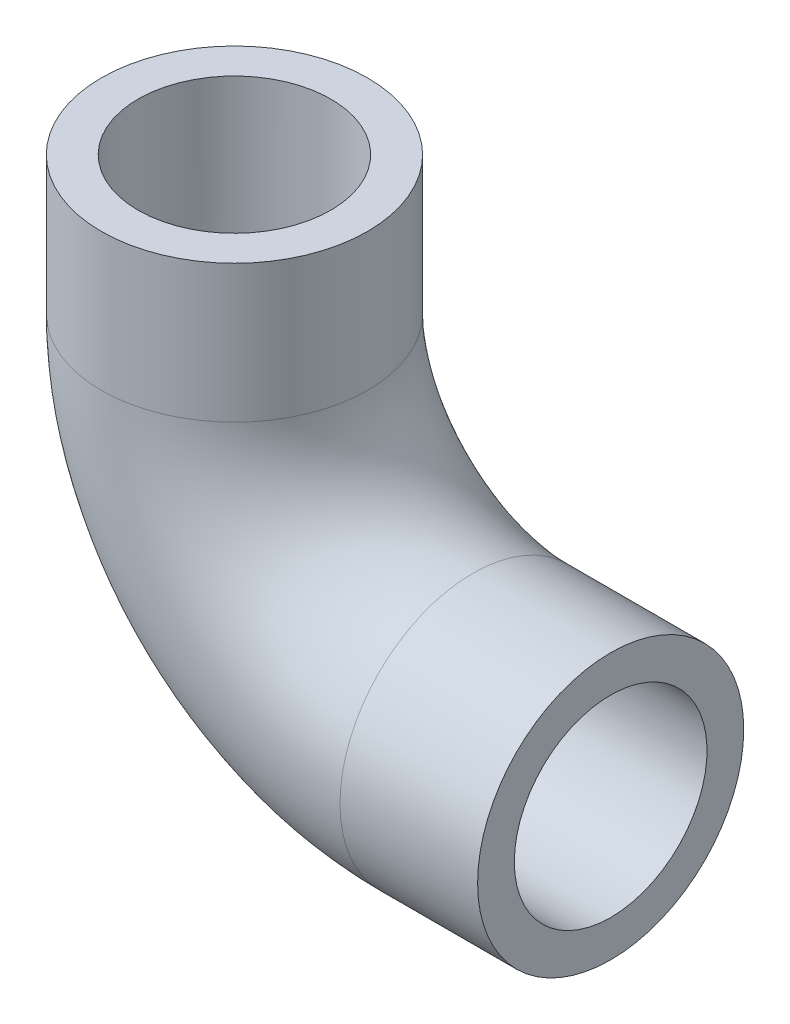
ISO-10303-21;
HEADER;
FILE_DESCRIPTION(('STEP AP214'),'2;1');
FILE_NAME('part.step','',(''),(''),'','','');
FILE_SCHEMA(('AUTOMOTIVE_DESIGN { 1 0 10303 214 1 1 1 1 }'));
ENDSEC;
DATA;
#1=APPLICATION_CONTEXT('core data for automotive mechanical design processes');
#2=APPLICATION_PROTOCOL_DEFINITION('international standard','automotive_design',2000,#1);
#3=PRODUCT_CONTEXT('',#1,'mechanical');
#4=PRODUCT('Part','Part','',(#3));
#5=PRODUCT_RELATED_PRODUCT_CATEGORY('part','',(#4));
#6=PRODUCT_DEFINITION_FORMATION('','',#4);
#7=PRODUCT_DEFINITION_CONTEXT('part definition',#1,'design');
#8=PRODUCT_DEFINITION('design','',#6,#7);
#9=PRODUCT_DEFINITION_SHAPE('','',#8);
#10=(LENGTH_UNIT() NAMED_UNIT(*) SI_UNIT(.MILLI.,.METRE.));
#11=(NAMED_UNIT(*) PLANE_ANGLE_UNIT() SI_UNIT($,.RADIAN.));
#12=(NAMED_UNIT(*) SI_UNIT($,.STERADIAN.) SOLID_ANGLE_UNIT());
#13=UNCERTAINTY_MEASURE_WITH_UNIT(LENGTH_MEASURE(1.E-05),#10,'distance_accuracy_value','');
#14=(GEOMETRIC_REPRESENTATION_CONTEXT(3) GLOBAL_UNCERTAINTY_ASSIGNED_CONTEXT((#13)) GLOBAL_UNIT_ASSIGNED_CONTEXT((#10,
#11,#12)) REPRESENTATION_CONTEXT('',''));
#15=CARTESIAN_POINT('',(0.,0.,0.));
#16=DIRECTION('',(0.,0.,1.));
#17=DIRECTION('',(1.,0.,0.));
#18=AXIS2_PLACEMENT_3D('',#15,#16,#17);
#19=CARTESIAN_POINT('',(0.,0.,0.));
#20=DIRECTION('',(0.,-1.,0.));
#21=DIRECTION('',(1.,0.,0.));
#22=AXIS2_PLACEMENT_3D('',#19,#20,#21);
#23=CYLINDRICAL_SURFACE('',#22,145.);
#24=CARTESIAN_POINT('',(0.,-150.,0.));
#25=DIRECTION('',(0.,1.,0.));
#26=DIRECTION('',(0.,0.,1.));
#27=AXIS2_PLACEMENT_3D('',#24,#25,#26);
#28=CIRCLE('',#27,145.);
#29=CARTESIAN_POINT('',(-145.,-150.,0.));
#30=VERTEX_POINT('',#29);
#31=EDGE_CURVE('E64',#30,#30,#28,.T.);
#32=ORIENTED_EDGE('',*,*,#31,.T.);
#33=EDGE_LOOP('',(#32));
#34=FACE_BOUND('',#33,.T.);
#35=CARTESIAN_POINT('',(0.,0.,0.));
#36=DIRECTION('',(0.,1.,0.));
#37=DIRECTION('',(0.,0.,1.));
#38=AXIS2_PLACEMENT_3D('',#35,#36,#37);
#39=CIRCLE('',#38,145.);
#40=CARTESIAN_POINT('',(0.,0.,145.));
#41=VERTEX_POINT('',#40);
#42=EDGE_CURVE('E61',#41,#41,#39,.T.);
#43=ORIENTED_EDGE('',*,*,#42,.F.);
#44=EDGE_LOOP('',(#43));
#45=FACE_BOUND('',#44,.T.);
#46=ADVANCED_FACE('F37',(#34,#45),#23,.T.);
#47=CARTESIAN_POINT('',(260.,-150.,0.));
#48=DIRECTION('',(0.,0.,1.));
#49=DIRECTION('',(1.,0.,0.));
#50=AXIS2_PLACEMENT_3D('',#47,#48,#49);
#51=TOROIDAL_SURFACE('',#50,260.,145.);
#52=CARTESIAN_POINT('',(260.000000000001,-410.,0.));
#53=DIRECTION('',(-1.,0.,0.));
#54=DIRECTION('',(0.,0.,1.));
#55=AXIS2_PLACEMENT_3D('',#52,#53,#54);
#56=CIRCLE('',#55,145.);
#57=CARTESIAN_POINT('',(260.000000000001,-555.,0.));
#58=VERTEX_POINT('',#57);
#59=EDGE_CURVE('E41',#58,#58,#56,.T.);
#60=CARTESIAN_POINT('',(260.,-150.,0.));
#61=DIRECTION('',(0.,0.,1.));
#62=DIRECTION('',(1.,0.,0.));
#63=AXIS2_PLACEMENT_3D('',#60,#61,#62);
#64=CIRCLE('',#63,405.);
#65=EDGE_CURVE('',#30,#58,#64,.T.);
#66=ORIENTED_EDGE('',*,*,#31,.F.);
#67=ORIENTED_EDGE('',*,*,#59,.T.);
#68=ORIENTED_EDGE('',*,*,#65,.T.);
#69=ORIENTED_EDGE('',*,*,#65,.F.);
#70=EDGE_LOOP('',(#66,#68,#67,#69));
#71=FACE_BOUND('',#70,.T.);
#72=ADVANCED_FACE('F73',(#71),#51,.T.);
#73=CARTESIAN_POINT('',(260.000000000001,-410.,0.));
#74=DIRECTION('',(1.,0.,0.));
#75=DIRECTION('',(0.,0.,-1.));
#76=AXIS2_PLACEMENT_3D('',#73,#74,#75);
#77=CYLINDRICAL_SURFACE('',#76,145.);
#78=CARTESIAN_POINT('',(410.,-410.,0.));
#79=DIRECTION('',(-1.,0.,0.));
#80=DIRECTION('',(0.,0.,1.));
#81=AXIS2_PLACEMENT_3D('',#78,#79,#80);
#82=CIRCLE('',#81,145.);
#83=CARTESIAN_POINT('',(410.,-410.,145.));
#84=VERTEX_POINT('',#83);
#85=EDGE_CURVE('E56',#84,#84,#82,.T.);
#86=ORIENTED_EDGE('',*,*,#85,.T.);
#87=EDGE_LOOP('',(#86));
#88=FACE_BOUND('',#87,.T.);
#89=ORIENTED_EDGE('',*,*,#59,.F.);
#90=EDGE_LOOP('',(#89));
#91=FACE_BOUND('',#90,.T.);
#92=ADVANCED_FACE('F39',(#88,#91),#77,.T.);
#93=CARTESIAN_POINT('',(0.,0.,0.));
#94=DIRECTION('',(0.,1.,0.));
#95=DIRECTION('',(0.,0.,1.));
#96=AXIS2_PLACEMENT_3D('',#93,#94,#95);
#97=PLANE('',#96);
#98=CARTESIAN_POINT('',(0.,0.,0.));
#99=DIRECTION('',(0.,1.,0.));
#100=DIRECTION('',(0.,0.,1.));
#101=AXIS2_PLACEMENT_3D('',#98,#99,#100);
#102=CIRCLE('',#101,105.);
#103=CARTESIAN_POINT('',(0.,0.,105.));
#104=VERTEX_POINT('',#103);
#105=EDGE_CURVE('E60',#104,#104,#102,.F.);
#106=ORIENTED_EDGE('',*,*,#105,.T.);
#107=EDGE_LOOP('',(#106));
#108=FACE_BOUND('',#107,.T.);
#109=ORIENTED_EDGE('',*,*,#42,.T.);
#110=EDGE_LOOP('',(#109));
#111=FACE_BOUND('',#110,.T.);
#112=ADVANCED_FACE('F77',(#108,#111),#97,.T.);
#113=CARTESIAN_POINT('',(410.,-410.,0.));
#114=DIRECTION('',(-1.,0.,0.));
#115=DIRECTION('',(0.,0.,1.));
#116=AXIS2_PLACEMENT_3D('',#113,#114,#115);
#117=PLANE('',#116);
#118=CARTESIAN_POINT('',(410.,-410.,0.));
#119=DIRECTION('',(-1.,0.,0.));
#120=DIRECTION('',(0.,0.,1.));
#121=AXIS2_PLACEMENT_3D('',#118,#119,#120);
#122=CIRCLE('',#121,105.);
#123=CARTESIAN_POINT('',(410.,-410.,105.));
#124=VERTEX_POINT('',#123);
#125=EDGE_CURVE('E10',#124,#124,#122,.F.);
#126=ORIENTED_EDGE('',*,*,#125,.F.);
#127=EDGE_LOOP('',(#126));
#128=FACE_BOUND('',#127,.T.);
#129=ORIENTED_EDGE('',*,*,#85,.F.);
#130=EDGE_LOOP('',(#129));
#131=FACE_BOUND('',#130,.T.);
#132=ADVANCED_FACE('F83',(#128,#131),#117,.F.);
#133=CARTESIAN_POINT('',(0.,0.,0.));
#134=DIRECTION('',(0.,-1.,0.));
#135=DIRECTION('',(1.,0.,0.));
#136=AXIS2_PLACEMENT_3D('',#133,#134,#135);
#137=CYLINDRICAL_SURFACE('',#136,105.);
#138=CARTESIAN_POINT('',(0.,-150.,0.));
#139=DIRECTION('',(0.,1.,0.));
#140=DIRECTION('',(0.,0.,1.));
#141=AXIS2_PLACEMENT_3D('',#138,#139,#140);
#142=CIRCLE('',#141,105.);
#143=CARTESIAN_POINT('',(-105.,-150.,0.));
#144=VERTEX_POINT('',#143);
#145=EDGE_CURVE('E52',#144,#144,#142,.F.);
#146=ORIENTED_EDGE('',*,*,#145,.T.);
#147=EDGE_LOOP('',(#146));
#148=FACE_BOUND('',#147,.T.);
#149=ORIENTED_EDGE('',*,*,#105,.F.);
#150=EDGE_LOOP('',(#149));
#151=FACE_BOUND('',#150,.T.);
#152=ADVANCED_FACE('F93',(#148,#151),#137,.F.);
#153=CARTESIAN_POINT('',(260.,-150.,0.));
#154=DIRECTION('',(0.,0.,1.));
#155=DIRECTION('',(1.,0.,0.));
#156=AXIS2_PLACEMENT_3D('',#153,#154,#155);
#157=TOROIDAL_SURFACE('',#156,260.,105.);
#158=CARTESIAN_POINT('',(260.000000000001,-410.,0.));
#159=DIRECTION('',(-1.,0.,0.));
#160=DIRECTION('',(0.,0.,1.));
#161=AXIS2_PLACEMENT_3D('',#158,#159,#160);
#162=CIRCLE('',#161,105.);
#163=CARTESIAN_POINT('',(260.000000000001,-515.,0.));
#164=VERTEX_POINT('',#163);
#165=EDGE_CURVE('E46',#164,#164,#162,.F.);
#166=CARTESIAN_POINT('',(260.,-150.,0.));
#167=DIRECTION('',(0.,0.,1.));
#168=DIRECTION('',(1.,0.,0.));
#169=AXIS2_PLACEMENT_3D('',#166,#167,#168);
#170=CIRCLE('',#169,365.);
#171=EDGE_CURVE('',#144,#164,#170,.T.);
#172=ORIENTED_EDGE('',*,*,#145,.F.);
#173=ORIENTED_EDGE('',*,*,#165,.T.);
#174=ORIENTED_EDGE('',*,*,#171,.T.);
#175=ORIENTED_EDGE('',*,*,#171,.F.);
#176=EDGE_LOOP('',(#172,#174,#173,#175));
#177=FACE_BOUND('',#176,.T.);
#178=ADVANCED_FACE('F88',(#177),#157,.F.);
#179=CARTESIAN_POINT('',(260.000000000001,-410.,0.));
#180=DIRECTION('',(1.,0.,0.));
#181=DIRECTION('',(0.,0.,-1.));
#182=AXIS2_PLACEMENT_3D('',#179,#180,#181);
#183=CYLINDRICAL_SURFACE('',#182,105.);
#184=ORIENTED_EDGE('',*,*,#125,.T.);
#185=EDGE_LOOP('',(#184));
#186=FACE_BOUND('',#185,.T.);
#187=ORIENTED_EDGE('',*,*,#165,.F.);
#188=EDGE_LOOP('',(#187));
#189=FACE_BOUND('',#188,.T.);
#190=ADVANCED_FACE('F86',(#186,#189),#183,.F.);
#191=CLOSED_SHELL('',(#46,#72,#92,#112,#132,#152,#178,#190));
#192=MANIFOLD_SOLID_BREP('B2',#191);
#193=ADVANCED_BREP_SHAPE_REPRESENTATION('',(#18,#192),#14);
#194=SHAPE_DEFINITION_REPRESENTATION(#9,#193);
ENDSEC;
END-ISO-10303-21;
